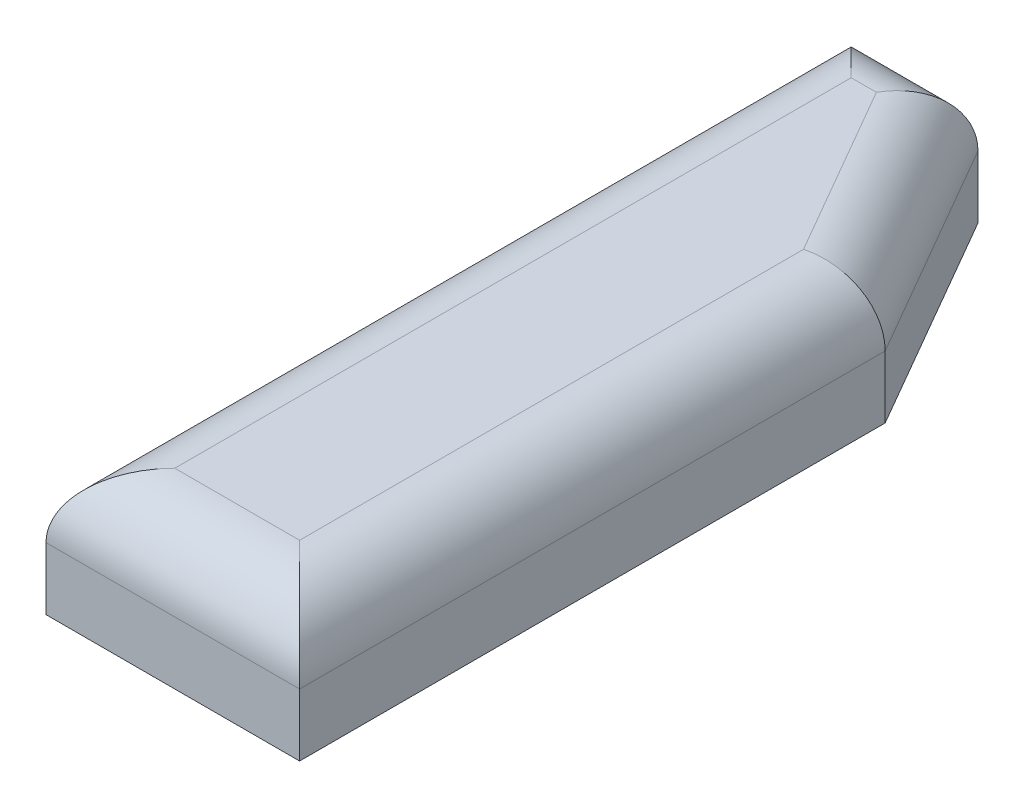
ISO-10303-21;
HEADER;
FILE_DESCRIPTION(('STEP AP214'),'2;1');
FILE_NAME('part.step','',(''),(''),'','','');
FILE_SCHEMA(('AUTOMOTIVE_DESIGN { 1 0 10303 214 1 1 1 1 }'));
ENDSEC;
DATA;
#1=APPLICATION_CONTEXT('core data for automotive mechanical design processes');
#2=APPLICATION_PROTOCOL_DEFINITION('international standard','automotive_design',2000,#1);
#3=PRODUCT_CONTEXT('',#1,'mechanical');
#4=PRODUCT('Part','Part','',(#3));
#5=PRODUCT_RELATED_PRODUCT_CATEGORY('part','',(#4));
#6=PRODUCT_DEFINITION_FORMATION('','',#4);
#7=PRODUCT_DEFINITION_CONTEXT('part definition',#1,'design');
#8=PRODUCT_DEFINITION('design','',#6,#7);
#9=PRODUCT_DEFINITION_SHAPE('','',#8);
#10=(LENGTH_UNIT() NAMED_UNIT(*) SI_UNIT(.MILLI.,.METRE.));
#11=(NAMED_UNIT(*) PLANE_ANGLE_UNIT() SI_UNIT($,.RADIAN.));
#12=(NAMED_UNIT(*) SI_UNIT($,.STERADIAN.) SOLID_ANGLE_UNIT());
#13=UNCERTAINTY_MEASURE_WITH_UNIT(LENGTH_MEASURE(1.E-05),#10,'distance_accuracy_value','');
#14=(GEOMETRIC_REPRESENTATION_CONTEXT(3) GLOBAL_UNCERTAINTY_ASSIGNED_CONTEXT((#13)) GLOBAL_UNIT_ASSIGNED_CONTEXT((#10,
#11,#12)) REPRESENTATION_CONTEXT('',''));
#15=CARTESIAN_POINT('',(0.,0.,0.));
#16=DIRECTION('',(0.,0.,1.));
#17=DIRECTION('',(1.,0.,0.));
#18=AXIS2_PLACEMENT_3D('',#15,#16,#17);
#19=CARTESIAN_POINT('',(-10.,10.,31.75));
#20=DIRECTION('',(0.,0.,-1.));
#21=DIRECTION('',(-1.,0.,0.));
#22=AXIS2_PLACEMENT_3D('',#19,#20,#21);
#23=PLANE('',#22);
#24=DIRECTION('',(0.,-1.,0.));
#25=VECTOR('',#24,1.);
#26=CARTESIAN_POINT('',(10.,10.,31.75));
#27=LINE('',#26,#25);
#28=CARTESIAN_POINT('',(10.,4.92,31.75));
#29=VERTEX_POINT('',#28);
#30=CARTESIAN_POINT('',(10.,0.,31.75));
#31=VERTEX_POINT('',#30);
#32=EDGE_CURVE('E95',#29,#31,#27,.T.);
#33=ORIENTED_EDGE('',*,*,#32,.F.);
#34=DIRECTION('',(1.,0.,0.));
#35=VECTOR('',#34,1.);
#36=CARTESIAN_POINT('',(-10.,4.92,31.75));
#37=LINE('',#36,#35);
#38=CARTESIAN_POINT('',(-10.,4.92,31.75));
#39=VERTEX_POINT('',#38);
#40=EDGE_CURVE('E149',#29,#39,#37,.F.);
#41=ORIENTED_EDGE('',*,*,#40,.T.);
#42=DIRECTION('',(0.,-1.,0.));
#43=VECTOR('',#42,1.);
#44=CARTESIAN_POINT('',(-10.,10.,31.75));
#45=LINE('',#44,#43);
#46=CARTESIAN_POINT('',(-10.,0.,31.75));
#47=VERTEX_POINT('',#46);
#48=EDGE_CURVE('E118',#39,#47,#45,.T.);
#49=ORIENTED_EDGE('',*,*,#48,.T.);
#50=DIRECTION('',(1.,0.,0.));
#51=VECTOR('',#50,1.);
#52=CARTESIAN_POINT('',(-10.,0.,31.75));
#53=LINE('',#52,#51);
#54=EDGE_CURVE('E112',#47,#31,#53,.T.);
#55=ORIENTED_EDGE('',*,*,#54,.T.);
#56=EDGE_LOOP('',(#33,#41,#49,#55));
#57=FACE_BOUND('',#56,.T.);
#58=ADVANCED_FACE('F33',(#57),#23,.F.);
#59=CARTESIAN_POINT('',(10.,10.,31.75));
#60=DIRECTION('',(-1.,0.,0.));
#61=DIRECTION('',(0.,0.,1.));
#62=AXIS2_PLACEMENT_3D('',#59,#60,#61);
#63=PLANE('',#62);
#64=DIRECTION('',(0.,-1.,0.));
#65=VECTOR('',#64,1.);
#66=CARTESIAN_POINT('',(10.,10.,-14.4294919243111));
#67=LINE('',#66,#65);
#68=CARTESIAN_POINT('',(10.,4.92,-14.4294919243111));
#69=VERTEX_POINT('',#68);
#70=CARTESIAN_POINT('',(10.,0.,-14.4294919243111));
#71=VERTEX_POINT('',#70);
#72=EDGE_CURVE('E106',#69,#71,#67,.T.);
#73=ORIENTED_EDGE('',*,*,#72,.F.);
#74=DIRECTION('',(0.,0.,-1.));
#75=VECTOR('',#74,1.);
#76=CARTESIAN_POINT('',(10.,4.92,31.75));
#77=LINE('',#76,#75);
#78=EDGE_CURVE('E101',#69,#29,#77,.F.);
#79=ORIENTED_EDGE('',*,*,#78,.T.);
#80=ORIENTED_EDGE('',*,*,#32,.T.);
#81=DIRECTION('',(0.,0.,-1.));
#82=VECTOR('',#81,1.);
#83=CARTESIAN_POINT('',(10.,0.,31.75));
#84=LINE('',#83,#82);
#85=EDGE_CURVE('E98',#31,#71,#84,.T.);
#86=ORIENTED_EDGE('',*,*,#85,.T.);
#87=EDGE_LOOP('',(#73,#79,#80,#86));
#88=FACE_BOUND('',#87,.T.);
#89=ADVANCED_FACE('F97',(#88),#63,.F.);
#90=CARTESIAN_POINT('',(10.,10.,-14.4294919243111));
#91=DIRECTION('',(-0.86602540378444,0.,0.499999999999998));
#92=DIRECTION('',(0.499999999999998,0.,0.86602540378444));
#93=AXIS2_PLACEMENT_3D('',#90,#91,#92);
#94=PLANE('',#93);
#95=DIRECTION('',(0.,-1.,0.));
#96=VECTOR('',#95,1.);
#97=CARTESIAN_POINT('',(0.,10.,-31.75));
#98=LINE('',#97,#96);
#99=CARTESIAN_POINT('',(0.,4.92,-31.75));
#100=VERTEX_POINT('',#99);
#101=CARTESIAN_POINT('',(0.,0.,-31.75));
#102=VERTEX_POINT('',#101);
#103=EDGE_CURVE('E133',#100,#102,#98,.T.);
#104=ORIENTED_EDGE('',*,*,#103,.F.);
#105=DIRECTION('',(-0.499999999999998,0.,-0.86602540378444));
#106=VECTOR('',#105,1.);
#107=CARTESIAN_POINT('',(10.,4.92,-14.4294919243111));
#108=LINE('',#107,#106);
#109=EDGE_CURVE('E11',#100,#69,#108,.F.);
#110=ORIENTED_EDGE('',*,*,#109,.T.);
#111=ORIENTED_EDGE('',*,*,#72,.T.);
#112=DIRECTION('',(-0.499999999999998,0.,-0.86602540378444));
#113=VECTOR('',#112,1.);
#114=CARTESIAN_POINT('',(10.,0.,-14.4294919243111));
#115=LINE('',#114,#113);
#116=EDGE_CURVE('E115',#71,#102,#115,.T.);
#117=ORIENTED_EDGE('',*,*,#116,.T.);
#118=EDGE_LOOP('',(#104,#110,#111,#117));
#119=FACE_BOUND('',#118,.T.);
#120=ADVANCED_FACE('F198',(#119),#94,.F.);
#121=CARTESIAN_POINT('',(0.,10.,-31.75));
#122=DIRECTION('',(0.,0.,1.));
#123=DIRECTION('',(1.,0.,0.));
#124=AXIS2_PLACEMENT_3D('',#121,#122,#123);
#125=PLANE('',#124);
#126=DIRECTION('',(0.,-1.,0.));
#127=VECTOR('',#126,1.);
#128=CARTESIAN_POINT('',(-10.,10.,-31.75));
#129=LINE('',#128,#127);
#130=CARTESIAN_POINT('',(-10.,4.92,-31.75));
#131=VERTEX_POINT('',#130);
#132=CARTESIAN_POINT('',(-10.,0.,-31.75));
#133=VERTEX_POINT('',#132);
#134=EDGE_CURVE('E131',#131,#133,#129,.T.);
#135=ORIENTED_EDGE('',*,*,#134,.F.);
#136=DIRECTION('',(-1.,0.,0.));
#137=VECTOR('',#136,1.);
#138=CARTESIAN_POINT('',(0.,4.92,-31.75));
#139=LINE('',#138,#137);
#140=EDGE_CURVE('E42',#131,#100,#139,.F.);
#141=ORIENTED_EDGE('',*,*,#140,.T.);
#142=ORIENTED_EDGE('',*,*,#103,.T.);
#143=DIRECTION('',(-1.,0.,0.));
#144=VECTOR('',#143,1.);
#145=CARTESIAN_POINT('',(0.,0.,-31.75));
#146=LINE('',#145,#144);
#147=EDGE_CURVE('E125',#102,#133,#146,.T.);
#148=ORIENTED_EDGE('',*,*,#147,.T.);
#149=EDGE_LOOP('',(#135,#141,#142,#148));
#150=FACE_BOUND('',#149,.T.);
#151=ADVANCED_FACE('F191',(#150),#125,.F.);
#152=CARTESIAN_POINT('',(-10.,10.,-31.75));
#153=DIRECTION('',(1.,0.,0.));
#154=DIRECTION('',(0.,0.,-1.));
#155=AXIS2_PLACEMENT_3D('',#152,#153,#154);
#156=PLANE('',#155);
#157=ORIENTED_EDGE('',*,*,#48,.F.);
#158=DIRECTION('',(0.,0.,1.));
#159=VECTOR('',#158,1.);
#160=CARTESIAN_POINT('',(-10.,4.92,-31.75));
#161=LINE('',#160,#159);
#162=EDGE_CURVE('E146',#39,#131,#161,.F.);
#163=ORIENTED_EDGE('',*,*,#162,.T.);
#164=ORIENTED_EDGE('',*,*,#134,.T.);
#165=DIRECTION('',(0.,0.,1.));
#166=VECTOR('',#165,1.);
#167=CARTESIAN_POINT('',(-10.,0.,-31.75));
#168=LINE('',#167,#166);
#169=EDGE_CURVE('E128',#133,#47,#168,.T.);
#170=ORIENTED_EDGE('',*,*,#169,.T.);
#171=EDGE_LOOP('',(#157,#163,#164,#170));
#172=FACE_BOUND('',#171,.T.);
#173=ADVANCED_FACE('F178',(#172),#156,.F.);
#174=CARTESIAN_POINT('',(0.,10.,0.));
#175=DIRECTION('',(0.,1.,0.));
#176=DIRECTION('',(0.,0.,1.));
#177=AXIS2_PLACEMENT_3D('',#174,#175,#176);
#178=PLANE('',#177);
#179=DIRECTION('',(-1.,0.,0.));
#180=VECTOR('',#179,1.);
#181=CARTESIAN_POINT('',(-10.,10.,-26.67));
#182=LINE('',#181,#180);
#183=CARTESIAN_POINT('',(-2.93293936748331,10.,-26.67));
#184=VERTEX_POINT('',#183);
#185=CARTESIAN_POINT('',(-4.92,10.,-26.67));
#186=VERTEX_POINT('',#185);
#187=EDGE_CURVE('E137',#184,#186,#182,.T.);
#188=ORIENTED_EDGE('',*,*,#187,.T.);
#189=DIRECTION('',(0.,0.,1.));
#190=VECTOR('',#189,1.);
#191=CARTESIAN_POINT('',(-4.92,10.,31.75));
#192=LINE('',#191,#190);
#193=CARTESIAN_POINT('',(-4.92,10.,26.67));
#194=VERTEX_POINT('',#193);
#195=EDGE_CURVE('E143',#186,#194,#192,.T.);
#196=ORIENTED_EDGE('',*,*,#195,.T.);
#197=DIRECTION('',(1.,0.,0.));
#198=VECTOR('',#197,1.);
#199=CARTESIAN_POINT('',(10.,10.,26.67));
#200=LINE('',#199,#198);
#201=CARTESIAN_POINT('',(4.92,10.,26.67));
#202=VERTEX_POINT('',#201);
#203=EDGE_CURVE('E141',#194,#202,#200,.T.);
#204=ORIENTED_EDGE('',*,*,#203,.T.);
#205=DIRECTION('',(0.,0.,-1.));
#206=VECTOR('',#205,1.);
#207=CARTESIAN_POINT('',(4.92,10.,-14.4294919243111));
#208=LINE('',#207,#206);
#209=CARTESIAN_POINT('',(4.92,10.,-13.068310026761));
#210=VERTEX_POINT('',#209);
#211=EDGE_CURVE('E139',#202,#210,#208,.T.);
#212=ORIENTED_EDGE('',*,*,#211,.T.);
#213=DIRECTION('',(-0.499999999999998,0.,-0.86602540378444));
#214=VECTOR('',#213,1.);
#215=CARTESIAN_POINT('',(-4.39940905122495,10.,-29.21));
#216=LINE('',#215,#214);
#217=EDGE_CURVE('E105',#210,#184,#216,.T.);
#218=ORIENTED_EDGE('',*,*,#217,.T.);
#219=EDGE_LOOP('',(#188,#196,#204,#212,#218));
#220=FACE_BOUND('',#219,.T.);
#221=ADVANCED_FACE('F183',(#220),#178,.T.);
#222=CARTESIAN_POINT('',(0.,0.,0.));
#223=DIRECTION('',(0.,1.,0.));
#224=DIRECTION('',(0.,0.,1.));
#225=AXIS2_PLACEMENT_3D('',#222,#223,#224);
#226=PLANE('',#225);
#227=ORIENTED_EDGE('',*,*,#54,.F.);
#228=ORIENTED_EDGE('',*,*,#169,.F.);
#229=ORIENTED_EDGE('',*,*,#147,.F.);
#230=ORIENTED_EDGE('',*,*,#116,.F.);
#231=ORIENTED_EDGE('',*,*,#85,.F.);
#232=EDGE_LOOP('',(#227,#228,#229,#230,#231));
#233=FACE_BOUND('',#232,.T.);
#234=ADVANCED_FACE('F110',(#233),#226,.F.);
#235=CARTESIAN_POINT('',(9.34874423385297,4.92,-5.39749999999995));
#236=DIRECTION('',(0.499999999999998,0.,0.86602540378444));
#237=DIRECTION('',(0.86602540378444,0.,-0.499999999999998));
#238=AXIS2_PLACEMENT_3D('',#235,#236,#237);
#239=CYLINDRICAL_SURFACE('',#238,5.08);
#240=CARTESIAN_POINT('',(-2.9329393674833,4.92,-26.67));
#241=DIRECTION('',(0.866025403784438,0.,0.500000000000001));
#242=DIRECTION('',(-0.500000000000001,0.,0.866025403784438));
#243=AXIS2_PLACEMENT_3D('',#240,#241,#242);
#244=ELLIPSE('',#243,5.8658787349666,5.08);
#245=EDGE_CURVE('E122',#184,#100,#244,.F.);
#246=ORIENTED_EDGE('',*,*,#245,.F.);
#247=ORIENTED_EDGE('',*,*,#217,.F.);
#248=CARTESIAN_POINT('',(4.92,4.92,-13.068310026761));
#249=DIRECTION('',(0.25881904510252,0.,0.965925826289069));
#250=DIRECTION('',(0.965925826289069,0.,-0.25881904510252));
#251=AXIS2_PLACEMENT_3D('',#248,#249,#250);
#252=ELLIPSE('',#251,5.25920299648322,5.08);
#253=EDGE_CURVE('E37',#69,#210,#252,.T.);
#254=ORIENTED_EDGE('',*,*,#253,.F.);
#255=ORIENTED_EDGE('',*,*,#109,.F.);
#256=EDGE_LOOP('',(#246,#247,#254,#255));
#257=FACE_BOUND('',#256,.T.);
#258=ADVANCED_FACE('F35',(#257),#239,.T.);
#259=CARTESIAN_POINT('',(4.92,4.92,0.));
#260=DIRECTION('',(0.,0.,1.));
#261=DIRECTION('',(1.,0.,0.));
#262=AXIS2_PLACEMENT_3D('',#259,#260,#261);
#263=CYLINDRICAL_SURFACE('',#262,5.08);
#264=ORIENTED_EDGE('',*,*,#253,.T.);
#265=ORIENTED_EDGE('',*,*,#211,.F.);
#266=CARTESIAN_POINT('',(4.92,4.92,26.67));
#267=DIRECTION('',(-0.707106781186547,0.,0.707106781186547));
#268=DIRECTION('',(0.707106781186547,0.,0.707106781186547));
#269=AXIS2_PLACEMENT_3D('',#266,#267,#268);
#270=ELLIPSE('',#269,7.18420489685532,5.08);
#271=EDGE_CURVE('E157',#29,#202,#270,.T.);
#272=ORIENTED_EDGE('',*,*,#271,.F.);
#273=ORIENTED_EDGE('',*,*,#78,.F.);
#274=EDGE_LOOP('',(#264,#265,#272,#273));
#275=FACE_BOUND('',#274,.T.);
#276=ADVANCED_FACE('F170',(#275),#263,.T.);
#277=CARTESIAN_POINT('',(0.,4.92,-26.67));
#278=DIRECTION('',(1.,0.,0.));
#279=DIRECTION('',(0.,0.,-1.));
#280=AXIS2_PLACEMENT_3D('',#277,#278,#279);
#281=CYLINDRICAL_SURFACE('',#280,5.08);
#282=ORIENTED_EDGE('',*,*,#245,.T.);
#283=ORIENTED_EDGE('',*,*,#140,.F.);
#284=CARTESIAN_POINT('',(-4.92,4.92,-26.67));
#285=DIRECTION('',(0.707106781186547,0.,-0.707106781186547));
#286=DIRECTION('',(0.707106781186547,0.,0.707106781186547));
#287=AXIS2_PLACEMENT_3D('',#284,#285,#286);
#288=ELLIPSE('',#287,7.18420489685532,5.08);
#289=EDGE_CURVE('E155',#186,#131,#288,.F.);
#290=ORIENTED_EDGE('',*,*,#289,.F.);
#291=ORIENTED_EDGE('',*,*,#187,.F.);
#292=EDGE_LOOP('',(#282,#283,#290,#291));
#293=FACE_BOUND('',#292,.T.);
#294=ADVANCED_FACE('F163',(#293),#281,.T.);
#295=CARTESIAN_POINT('',(0.,4.92,26.67));
#296=DIRECTION('',(-1.,0.,0.));
#297=DIRECTION('',(0.,0.,1.));
#298=AXIS2_PLACEMENT_3D('',#295,#296,#297);
#299=CYLINDRICAL_SURFACE('',#298,5.08);
#300=ORIENTED_EDGE('',*,*,#271,.T.);
#301=ORIENTED_EDGE('',*,*,#203,.F.);
#302=CARTESIAN_POINT('',(-4.92,4.92,26.67));
#303=DIRECTION('',(-0.707106781186547,0.,-0.707106781186547));
#304=DIRECTION('',(-0.707106781186547,0.,0.707106781186547));
#305=AXIS2_PLACEMENT_3D('',#302,#303,#304);
#306=ELLIPSE('',#305,7.18420489685532,5.08);
#307=EDGE_CURVE('E153',#39,#194,#306,.T.);
#308=ORIENTED_EDGE('',*,*,#307,.F.);
#309=ORIENTED_EDGE('',*,*,#40,.F.);
#310=EDGE_LOOP('',(#300,#301,#308,#309));
#311=FACE_BOUND('',#310,.T.);
#312=ADVANCED_FACE('F175',(#311),#299,.T.);
#313=CARTESIAN_POINT('',(-4.92,4.92,0.));
#314=DIRECTION('',(0.,0.,-1.));
#315=DIRECTION('',(-1.,0.,0.));
#316=AXIS2_PLACEMENT_3D('',#313,#314,#315);
#317=CYLINDRICAL_SURFACE('',#316,5.08);
#318=ORIENTED_EDGE('',*,*,#289,.T.);
#319=ORIENTED_EDGE('',*,*,#162,.F.);
#320=ORIENTED_EDGE('',*,*,#307,.T.);
#321=ORIENTED_EDGE('',*,*,#195,.F.);
#322=EDGE_LOOP('',(#318,#319,#320,#321));
#323=FACE_BOUND('',#322,.T.);
#324=ADVANCED_FACE('F180',(#323),#317,.T.);
#325=CLOSED_SHELL('',(#58,#89,#120,#151,#173,#221,#234,#258,#276,#294,#312,#324));
#326=MANIFOLD_SOLID_BREP('B2',#325);
#327=ADVANCED_BREP_SHAPE_REPRESENTATION('',(#18,#326),#14);
#328=SHAPE_DEFINITION_REPRESENTATION(#9,#327);
ENDSEC;
END-ISO-10303-21;
